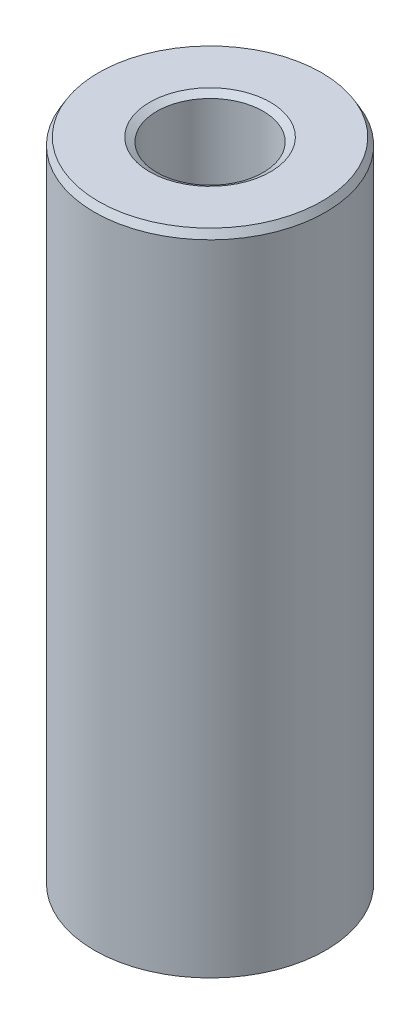
ISO-10303-21;
HEADER;
FILE_DESCRIPTION(('STEP AP214'),'2;1');
FILE_NAME('part.step','',(''),(''),'','','');
FILE_SCHEMA(('AUTOMOTIVE_DESIGN { 1 0 10303 214 1 1 1 1 }'));
ENDSEC;
DATA;
#1=APPLICATION_CONTEXT('core data for automotive mechanical design processes');
#2=APPLICATION_PROTOCOL_DEFINITION('international standard','automotive_design',2000,#1);
#3=PRODUCT_CONTEXT('',#1,'mechanical');
#4=PRODUCT('Part','Part','',(#3));
#5=PRODUCT_RELATED_PRODUCT_CATEGORY('part','',(#4));
#6=PRODUCT_DEFINITION_FORMATION('','',#4);
#7=PRODUCT_DEFINITION_CONTEXT('part definition',#1,'design');
#8=PRODUCT_DEFINITION('design','',#6,#7);
#9=PRODUCT_DEFINITION_SHAPE('','',#8);
#10=(LENGTH_UNIT() NAMED_UNIT(*) SI_UNIT(.MILLI.,.METRE.));
#11=(NAMED_UNIT(*) PLANE_ANGLE_UNIT() SI_UNIT($,.RADIAN.));
#12=(NAMED_UNIT(*) SI_UNIT($,.STERADIAN.) SOLID_ANGLE_UNIT());
#13=UNCERTAINTY_MEASURE_WITH_UNIT(LENGTH_MEASURE(1.E-05),#10,'distance_accuracy_value','');
#14=(GEOMETRIC_REPRESENTATION_CONTEXT(3) GLOBAL_UNCERTAINTY_ASSIGNED_CONTEXT((#13)) GLOBAL_UNIT_ASSIGNED_CONTEXT((#10,
#11,#12)) REPRESENTATION_CONTEXT('',''));
#15=CARTESIAN_POINT('',(0.,0.,0.));
#16=DIRECTION('',(0.,0.,1.));
#17=DIRECTION('',(1.,0.,0.));
#18=AXIS2_PLACEMENT_3D('',#15,#16,#17);
#19=CARTESIAN_POINT('',(0.,295.200925150064,0.));
#20=DIRECTION('',(0.,-1.,0.));
#21=DIRECTION('',(0.,0.,-1.));
#22=AXIS2_PLACEMENT_3D('',#19,#20,#21);
#23=CYLINDRICAL_SURFACE('',#22,52.5);
#24=CARTESIAN_POINT('',(0.,1.88962159243139,0.));
#25=DIRECTION('',(0.,1.,0.));
#26=DIRECTION('',(0.,0.,1.));
#27=AXIS2_PLACEMENT_3D('',#24,#25,#26);
#28=CIRCLE('',#27,52.5);
#29=CARTESIAN_POINT('',(0.,1.88962159243139,52.5));
#30=VERTEX_POINT('',#29);
#31=EDGE_CURVE('E10',#30,#30,#28,.T.);
#32=ORIENTED_EDGE('',*,*,#31,.T.);
#33=EDGE_LOOP('',(#32));
#34=FACE_BOUND('',#33,.T.);
#35=CARTESIAN_POINT('',(0.,291.928004544894,0.));
#36=DIRECTION('',(0.,1.,0.));
#37=DIRECTION('',(0.,0.,1.));
#38=AXIS2_PLACEMENT_3D('',#35,#36,#37);
#39=CIRCLE('',#38,52.5);
#40=CARTESIAN_POINT('',(0.,291.928004544894,52.5));
#41=VERTEX_POINT('',#40);
#42=EDGE_CURVE('E50',#41,#41,#39,.F.);
#43=ORIENTED_EDGE('',*,*,#42,.T.);
#44=EDGE_LOOP('',(#43));
#45=FACE_BOUND('',#44,.T.);
#46=ADVANCED_FACE('F39',(#34,#45),#23,.T.);
#47=CARTESIAN_POINT('',(0.,295.200925150064,0.));
#48=DIRECTION('',(0.,1.,0.));
#49=DIRECTION('',(0.,0.,1.));
#50=AXIS2_PLACEMENT_3D('',#47,#48,#49);
#51=PLANE('',#50);
#52=CARTESIAN_POINT('',(0.,295.200925150064,0.));
#53=DIRECTION('',(0.,1.,0.));
#54=DIRECTION('',(0.,0.,1.));
#55=AXIS2_PLACEMENT_3D('',#52,#53,#54);
#56=CIRCLE('',#55,27.3866779884738);
#57=CARTESIAN_POINT('',(0.,295.200925150064,27.3866779884738));
#58=VERTEX_POINT('',#57);
#59=EDGE_CURVE('E58',#58,#58,#56,.F.);
#60=ORIENTED_EDGE('',*,*,#59,.T.);
#61=EDGE_LOOP('',(#60));
#62=FACE_BOUND('',#61,.T.);
#63=CARTESIAN_POINT('',(0.,295.200925150064,0.));
#64=DIRECTION('',(0.,1.,0.));
#65=DIRECTION('',(0.,0.,1.));
#66=AXIS2_PLACEMENT_3D('',#63,#64,#65);
#67=CIRCLE('',#66,50.6103784075687);
#68=CARTESIAN_POINT('',(0.,295.200925150064,50.6103784075687));
#69=VERTEX_POINT('',#68);
#70=EDGE_CURVE('E61',#69,#69,#67,.T.);
#71=ORIENTED_EDGE('',*,*,#70,.T.);
#72=EDGE_LOOP('',(#71));
#73=FACE_BOUND('',#72,.T.);
#74=ADVANCED_FACE('F88',(#62,#73),#51,.T.);
#75=CARTESIAN_POINT('',(0.,0.,0.));
#76=DIRECTION('',(0.,1.,0.));
#77=DIRECTION('',(0.,0.,1.));
#78=AXIS2_PLACEMENT_3D('',#75,#76,#77);
#79=PLANE('',#78);
#80=CARTESIAN_POINT('',(0.,0.,0.));
#81=DIRECTION('',(0.,1.,0.));
#82=DIRECTION('',(0.,0.,1.));
#83=AXIS2_PLACEMENT_3D('',#80,#81,#82);
#84=CIRCLE('',#83,26.0033789757348);
#85=CARTESIAN_POINT('',(0.,0.,26.0033789757348));
#86=VERTEX_POINT('',#85);
#87=EDGE_CURVE('E51',#86,#86,#84,.T.);
#88=ORIENTED_EDGE('',*,*,#87,.T.);
#89=EDGE_LOOP('',(#88));
#90=FACE_BOUND('',#89,.T.);
#91=CARTESIAN_POINT('',(0.,0.,0.));
#92=DIRECTION('',(0.,1.,0.));
#93=DIRECTION('',(0.,0.,1.));
#94=AXIS2_PLACEMENT_3D('',#91,#92,#93);
#95=CIRCLE('',#94,49.2270793948296);
#96=CARTESIAN_POINT('',(0.,0.,49.2270793948296));
#97=VERTEX_POINT('',#96);
#98=EDGE_CURVE('E54',#97,#97,#95,.F.);
#99=ORIENTED_EDGE('',*,*,#98,.T.);
#100=EDGE_LOOP('',(#99));
#101=FACE_BOUND('',#100,.T.);
#102=ADVANCED_FACE('F83',(#90,#101),#79,.F.);
#103=CARTESIAN_POINT('',(0.,295.200925150064,0.));
#104=DIRECTION('',(0.,-1.,0.));
#105=DIRECTION('',(0.,0.,-1.));
#106=AXIS2_PLACEMENT_3D('',#103,#104,#105);
#107=CYLINDRICAL_SURFACE('',#106,24.1137573833034);
#108=CARTESIAN_POINT('',(0.,293.311303557633,0.));
#109=DIRECTION('',(0.,1.,0.));
#110=DIRECTION('',(0.,0.,1.));
#111=AXIS2_PLACEMENT_3D('',#108,#109,#110);
#112=CIRCLE('',#111,24.1137573833034);
#113=CARTESIAN_POINT('',(0.,293.311303557633,24.1137573833034));
#114=VERTEX_POINT('',#113);
#115=EDGE_CURVE('E67',#114,#114,#112,.T.);
#116=ORIENTED_EDGE('',*,*,#115,.T.);
#117=EDGE_LOOP('',(#116));
#118=FACE_BOUND('',#117,.T.);
#119=CARTESIAN_POINT('',(0.,3.27292060517048,0.));
#120=DIRECTION('',(0.,1.,0.));
#121=DIRECTION('',(0.,0.,1.));
#122=AXIS2_PLACEMENT_3D('',#119,#120,#121);
#123=CIRCLE('',#122,24.1137573833034);
#124=CARTESIAN_POINT('',(0.,3.27292060517048,24.1137573833034));
#125=VERTEX_POINT('',#124);
#126=EDGE_CURVE('E69',#125,#125,#123,.F.);
#127=ORIENTED_EDGE('',*,*,#126,.T.);
#128=EDGE_LOOP('',(#127));
#129=FACE_BOUND('',#128,.T.);
#130=ADVANCED_FACE('F71',(#118,#129),#107,.F.);
#131=CARTESIAN_POINT('',(0.,293.311303557633,0.));
#132=DIRECTION('',(0.,1.,0.));
#133=DIRECTION('',(0.,0.,1.));
#134=AXIS2_PLACEMENT_3D('',#131,#132,#133);
#135=CONICAL_SURFACE('',#134,24.1137573833034,1.04719755119659);
#136=ORIENTED_EDGE('',*,*,#59,.F.);
#137=EDGE_LOOP('',(#136));
#138=FACE_BOUND('',#137,.T.);
#139=ORIENTED_EDGE('',*,*,#115,.F.);
#140=EDGE_LOOP('',(#139));
#141=FACE_BOUND('',#140,.T.);
#142=ADVANCED_FACE('F77',(#138,#141),#135,.F.);
#143=CARTESIAN_POINT('',(0.,0.,0.));
#144=DIRECTION('',(0.,-1.,0.));
#145=DIRECTION('',(0.,0.,-1.));
#146=AXIS2_PLACEMENT_3D('',#143,#144,#145);
#147=CONICAL_SURFACE('',#146,26.0033789757348,0.523598775598295);
#148=ORIENTED_EDGE('',*,*,#126,.F.);
#149=EDGE_LOOP('',(#148));
#150=FACE_BOUND('',#149,.T.);
#151=ORIENTED_EDGE('',*,*,#87,.F.);
#152=EDGE_LOOP('',(#151));
#153=FACE_BOUND('',#152,.T.);
#154=ADVANCED_FACE('F73',(#150,#153),#147,.F.);
#155=CARTESIAN_POINT('',(0.,1.88962159243139,0.));
#156=DIRECTION('',(0.,1.,0.));
#157=DIRECTION('',(0.,0.,1.));
#158=AXIS2_PLACEMENT_3D('',#155,#156,#157);
#159=CONICAL_SURFACE('',#158,52.5,1.0471975511966);
#160=ORIENTED_EDGE('',*,*,#98,.F.);
#161=EDGE_LOOP('',(#160));
#162=FACE_BOUND('',#161,.T.);
#163=ORIENTED_EDGE('',*,*,#31,.F.);
#164=EDGE_LOOP('',(#163));
#165=FACE_BOUND('',#164,.T.);
#166=ADVANCED_FACE('F76',(#162,#165),#159,.T.);
#167=CARTESIAN_POINT('',(0.,295.200925150064,0.));
#168=DIRECTION('',(0.,-1.,0.));
#169=DIRECTION('',(0.,0.,-1.));
#170=AXIS2_PLACEMENT_3D('',#167,#168,#169);
#171=CONICAL_SURFACE('',#170,50.6103784075687,0.523598775598296);
#172=ORIENTED_EDGE('',*,*,#42,.F.);
#173=EDGE_LOOP('',(#172));
#174=FACE_BOUND('',#173,.T.);
#175=ORIENTED_EDGE('',*,*,#70,.F.);
#176=EDGE_LOOP('',(#175));
#177=FACE_BOUND('',#176,.T.);
#178=ADVANCED_FACE('F45',(#174,#177),#171,.T.);
#179=CLOSED_SHELL('',(#46,#74,#102,#130,#142,#154,#166,#178));
#180=MANIFOLD_SOLID_BREP('B2',#179);
#181=ADVANCED_BREP_SHAPE_REPRESENTATION('',(#18,#180),#14);
#182=SHAPE_DEFINITION_REPRESENTATION(#9,#181);
ENDSEC;
END-ISO-10303-21;
